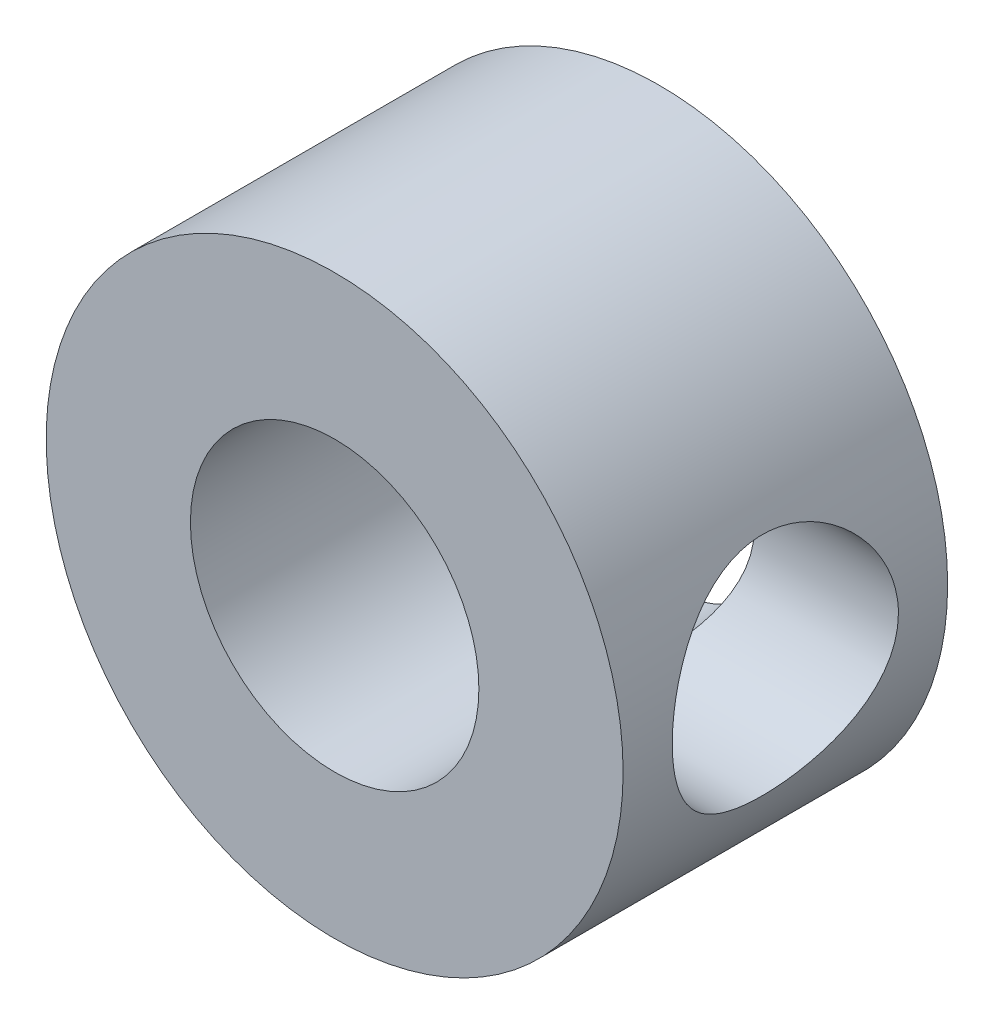
ISO-10303-21;
HEADER;
FILE_DESCRIPTION(('STEP AP214'),'2;1');
FILE_NAME('part.step','',(''),(''),'','','');
FILE_SCHEMA(('AUTOMOTIVE_DESIGN { 1 0 10303 214 1 1 1 1 }'));
ENDSEC;
DATA;
#1=APPLICATION_CONTEXT('core data for automotive mechanical design processes');
#2=APPLICATION_PROTOCOL_DEFINITION('international standard','automotive_design',2000,#1);
#3=PRODUCT_CONTEXT('',#1,'mechanical');
#4=PRODUCT('Part','Part','',(#3));
#5=PRODUCT_RELATED_PRODUCT_CATEGORY('part','',(#4));
#6=PRODUCT_DEFINITION_FORMATION('','',#4);
#7=PRODUCT_DEFINITION_CONTEXT('part definition',#1,'design');
#8=PRODUCT_DEFINITION('design','',#6,#7);
#9=PRODUCT_DEFINITION_SHAPE('','',#8);
#10=(LENGTH_UNIT() NAMED_UNIT(*) SI_UNIT(.MILLI.,.METRE.));
#11=(NAMED_UNIT(*) PLANE_ANGLE_UNIT() SI_UNIT($,.RADIAN.));
#12=(NAMED_UNIT(*) SI_UNIT($,.STERADIAN.) SOLID_ANGLE_UNIT());
#13=UNCERTAINTY_MEASURE_WITH_UNIT(LENGTH_MEASURE(1.E-05),#10,'distance_accuracy_value','');
#14=(GEOMETRIC_REPRESENTATION_CONTEXT(3) GLOBAL_UNCERTAINTY_ASSIGNED_CONTEXT((#13)) GLOBAL_UNIT_ASSIGNED_CONTEXT((#10,
#11,#12)) REPRESENTATION_CONTEXT('',''));
#15=CARTESIAN_POINT('',(0.,0.,0.));
#16=DIRECTION('',(0.,0.,1.));
#17=DIRECTION('',(1.,0.,0.));
#18=AXIS2_PLACEMENT_3D('',#15,#16,#17);
#19=CARTESIAN_POINT('',(0.,0.,7.14375));
#20=DIRECTION('',(0.,0.,1.));
#21=DIRECTION('',(1.,0.,0.));
#22=AXIS2_PLACEMENT_3D('',#19,#20,#21);
#23=PLANE('',#22);
#24=CARTESIAN_POINT('',(0.,0.,7.14375));
#25=DIRECTION('',(0.,0.,1.));
#26=DIRECTION('',(1.,0.,0.));
#27=AXIS2_PLACEMENT_3D('',#24,#25,#26);
#28=CIRCLE('',#27,6.35);
#29=CARTESIAN_POINT('',(6.35,0.,7.14375));
#30=VERTEX_POINT('',#29);
#31=EDGE_CURVE('E10',#30,#30,#28,.T.);
#32=ORIENTED_EDGE('',*,*,#31,.T.);
#33=EDGE_LOOP('',(#32));
#34=FACE_BOUND('',#33,.T.);
#35=CARTESIAN_POINT('',(0.,0.,7.14375));
#36=DIRECTION('',(0.,0.,1.));
#37=DIRECTION('',(1.,0.,0.));
#38=AXIS2_PLACEMENT_3D('',#35,#36,#37);
#39=CIRCLE('',#38,3.175);
#40=CARTESIAN_POINT('',(3.175,0.,7.14375));
#41=VERTEX_POINT('',#40);
#42=EDGE_CURVE('E45',#41,#41,#39,.T.);
#43=ORIENTED_EDGE('',*,*,#42,.F.);
#44=EDGE_LOOP('',(#43));
#45=FACE_BOUND('',#44,.T.);
#46=ADVANCED_FACE('F33',(#34,#45),#23,.T.);
#47=CARTESIAN_POINT('',(0.,0.,0.));
#48=DIRECTION('',(0.,0.,1.));
#49=DIRECTION('',(1.,0.,0.));
#50=AXIS2_PLACEMENT_3D('',#47,#48,#49);
#51=PLANE('',#50);
#52=CARTESIAN_POINT('',(0.,0.,0.));
#53=DIRECTION('',(0.,0.,1.));
#54=DIRECTION('',(1.,0.,0.));
#55=AXIS2_PLACEMENT_3D('',#52,#53,#54);
#56=CIRCLE('',#55,6.35);
#57=CARTESIAN_POINT('',(6.35,0.,0.));
#58=VERTEX_POINT('',#57);
#59=EDGE_CURVE('E38',#58,#58,#56,.T.);
#60=ORIENTED_EDGE('',*,*,#59,.F.);
#61=EDGE_LOOP('',(#60));
#62=FACE_BOUND('',#61,.T.);
#63=CARTESIAN_POINT('',(0.,0.,0.));
#64=DIRECTION('',(0.,0.,1.));
#65=DIRECTION('',(1.,0.,0.));
#66=AXIS2_PLACEMENT_3D('',#63,#64,#65);
#67=CIRCLE('',#66,3.175);
#68=CARTESIAN_POINT('',(3.175,0.,0.));
#69=VERTEX_POINT('',#68);
#70=EDGE_CURVE('E47',#69,#69,#67,.T.);
#71=ORIENTED_EDGE('',*,*,#70,.T.);
#72=EDGE_LOOP('',(#71));
#73=FACE_BOUND('',#72,.T.);
#74=ADVANCED_FACE('F74',(#62,#73),#51,.F.);
#75=CARTESIAN_POINT('',(0.,0.,7.14375));
#76=DIRECTION('',(0.,0.,-1.));
#77=DIRECTION('',(-1.,0.,0.));
#78=AXIS2_PLACEMENT_3D('',#75,#76,#77);
#79=CYLINDRICAL_SURFACE('',#78,6.35);
#80=CARTESIAN_POINT('',(6.35,0.,1.08336811795992));
#81=CARTESIAN_POINT('',(6.35000545513633,-0.134365584905921,1.08336104813344));
#82=CARTESIAN_POINT('',(6.34569919607395,-0.268685164184845,1.09428080479246));
#83=CARTESIAN_POINT('',(6.32895430273521,-0.533286588736778,1.13747493772504));
#84=CARTESIAN_POINT('',(6.31651764140518,-0.663569405550613,1.16974413330642));
#85=CARTESIAN_POINT('',(6.2848394308242,-0.916240679027884,1.25430465639991));
#86=CARTESIAN_POINT('',(6.26561175190318,-1.03864462990077,1.30655519084516));
#87=CARTESIAN_POINT('',(6.22224665454074,-1.27293328014172,1.42937770064108));
#88=CARTESIAN_POINT('',(6.19810780178079,-1.38481489244865,1.49995503003793));
#89=CARTESIAN_POINT('',(6.14615702665636,-1.60000446005501,1.66079297507217));
#90=CARTESIAN_POINT('',(6.11823466136445,-1.70276835120586,1.75174545573723));
#91=CARTESIAN_POINT('',(6.06238156007363,-1.89203184927024,1.94928304598323));
#92=CARTESIAN_POINT('',(6.03445082454259,-1.97852578470697,2.05587358380916));
#93=CARTESIAN_POINT('',(5.98042612533988,-2.13641590923239,2.28716443460609));
#94=CARTESIAN_POINT('',(5.95446032205108,-2.20701609317026,2.41244112554267));
#95=CARTESIAN_POINT('',(5.9090411931179,-2.32590038417542,2.67426493441599));
#96=CARTESIAN_POINT('',(5.88958499208708,-2.37419434782264,2.81080704293989));
#97=CARTESIAN_POINT('',(5.8605771307609,-2.44490220539705,3.08500300380676));
#98=CARTESIAN_POINT('',(5.8506274685615,-2.46836098023931,3.22234380326284));
#99=CARTESIAN_POINT('',(5.84060175728777,-2.49199779436003,3.49934538098847));
#100=CARTESIAN_POINT('',(5.84052112900121,-2.49218663084416,3.63900505321947));
#101=CARTESIAN_POINT('',(5.84990195005161,-2.47007217806116,3.90680123403268));
#102=CARTESIAN_POINT('',(5.85873047564688,-2.44926079151003,4.03508735854082));
#103=CARTESIAN_POINT('',(5.88387593621575,-2.38821734259702,4.28617466326235));
#104=CARTESIAN_POINT('',(5.90019410863688,-2.34798207094299,4.40897493341646));
#105=CARTESIAN_POINT('',(5.93883251538668,-2.2484784146089,4.64849611530154));
#106=CARTESIAN_POINT('',(5.96126601737259,-2.18884626402989,4.76504682552595));
#107=CARTESIAN_POINT('',(6.00957411421176,-2.05249627540497,4.98690356425207));
#108=CARTESIAN_POINT('',(6.03544996961245,-1.97577217152043,5.09220544798163));
#109=CARTESIAN_POINT('',(6.09005993945317,-1.8007407441697,5.29677236520375));
#110=CARTESIAN_POINT('',(6.11886388871933,-1.70125661271393,5.39501448050675));
#111=CARTESIAN_POINT('',(6.17445115700628,-1.48690981684088,5.57374064047986));
#112=CARTESIAN_POINT('',(6.20123410468441,-1.37204433693128,5.65422142685303));
#113=CARTESIAN_POINT('',(6.25038561038936,-1.1273897475065,5.79641152211744));
#114=CARTESIAN_POINT('',(6.27266443774011,-0.997366046580318,5.85775044930889));
#115=CARTESIAN_POINT('',(6.309623459392,-0.727751723244816,5.95733602874321));
#116=CARTESIAN_POINT('',(6.32430735422533,-0.588165797521133,5.99559392843186));
#117=CARTESIAN_POINT('',(6.3437553205587,-0.311975114697822,6.04589613336093));
#118=CARTESIAN_POINT('',(6.34903926581758,-0.175657331323717,6.05931601606586));
#119=CARTESIAN_POINT('',(6.35071944123578,0.097370738910688,6.06360464416098));
#120=CARTESIAN_POINT('',(6.3471178638622,0.234080920634157,6.0544789525805));
#121=CARTESIAN_POINT('',(6.33177301842518,0.497873293930373,6.01495848636519));
#122=CARTESIAN_POINT('',(6.32038463721726,0.625117175209849,5.98549028857833));
#123=CARTESIAN_POINT('',(6.29097552295061,0.872746274965058,5.90736873269536));
#124=CARTESIAN_POINT('',(6.27295393308272,0.993130605074175,5.85871289608085));
#125=CARTESIAN_POINT('',(6.23135931272748,1.22771687293366,5.74201741597362));
#126=CARTESIAN_POINT('',(6.20763478732306,1.34162146893583,5.67343573380022));
#127=CARTESIAN_POINT('',(6.15722385682927,1.55670058460538,5.51944009908576));
#128=CARTESIAN_POINT('',(6.13053629420074,1.6578700960226,5.43401955810396));
#129=CARTESIAN_POINT('',(6.0750169513665,1.85133337687063,5.24240922254003));
#130=CARTESIAN_POINT('',(6.04615654147027,1.94265704219348,5.13524567838425));
#131=CARTESIAN_POINT('',(5.9911341280294,2.10624816133522,4.90658405407908));
#132=CARTESIAN_POINT('',(5.96497249827361,2.17851297760018,4.78508399326331));
#133=CARTESIAN_POINT('',(5.91832247370527,2.3022571820242,4.52965274527073));
#134=CARTESIAN_POINT('',(5.89787962530376,2.35357111565625,4.39563250143547));
#135=CARTESIAN_POINT('',(5.86576301128476,2.43252456542703,4.11981564601188));
#136=CARTESIAN_POINT('',(5.85408312112941,2.4601806182444,3.97802454008569));
#137=CARTESIAN_POINT('',(5.84167696022346,2.48948586384106,3.70130952553694));
#138=CARTESIAN_POINT('',(5.84024579758222,2.49280902406863,3.56659327741807));
#139=CARTESIAN_POINT('',(5.84666520244753,2.47771522167332,3.29862282018771));
#140=CARTESIAN_POINT('',(5.85451470694218,2.45930074888935,3.16536844539687));
#141=CARTESIAN_POINT('',(5.87800035129194,2.40260151094814,2.90906917580799));
#142=CARTESIAN_POINT('',(5.8933420997075,2.36506583800947,2.78582917931971));
#143=CARTESIAN_POINT('',(5.92988758474608,2.27187710188837,2.54733941403855));
#144=CARTESIAN_POINT('',(5.95109286317444,2.21621927283125,2.43209175680109));
#145=CARTESIAN_POINT('',(5.99844525911191,2.08477495158031,2.20586165341153));
#146=CARTESIAN_POINT('',(6.02480198593947,2.00803922516091,2.0954752502654));
#147=CARTESIAN_POINT('',(6.07882330885569,1.83803081049928,1.88861498013543));
#148=CARTESIAN_POINT('',(6.10648833718916,1.74475262846769,1.79214575444084));
#149=CARTESIAN_POINT('',(6.16204641164539,1.53748636811623,1.60980474002559));
#150=CARTESIAN_POINT('',(6.18984947752698,1.42257928032945,1.52494508365494));
#151=CARTESIAN_POINT('',(6.24079820469859,1.17915056720893,1.37572789268335));
#152=CARTESIAN_POINT('',(6.26394274398275,1.05062567337776,1.31137529503484));
#153=CARTESIAN_POINT('',(6.30455046538143,0.772309883998053,1.20110415456855));
#154=CARTESIAN_POINT('',(6.32138644594636,0.621639311170629,1.1571473631246));
#155=CARTESIAN_POINT('',(6.34410455966513,0.313955516139854,1.09829267306016));
#156=CARTESIAN_POINT('',(6.34999362810151,0.15694637413187,1.08337637590509));
#157=CARTESIAN_POINT('',(6.35,0.,1.08336811795992));
#158=B_SPLINE_CURVE_WITH_KNOTS('',3,(#80,#81,#82,#83,#84,#85,#86,#87,#88,#89,#90,#91,#92,#93,
#94,#95,#96,#97,#98,#99,#100,#101,#102,#103,#104,#105,#106,#107,#108,#109,#110,#111,#112,#113,
#114,#115,#116,#117,#118,#119,#120,#121,#122,#123,#124,#125,#126,#127,#128,#129,#130,#131,#132,
#133,#134,#135,#136,#137,#138,#139,#140,#141,#142,#143,#144,#145,#146,#147,#148,#149,#150,#151,
#152,#153,#154,#155,#156,#157),.UNSPECIFIED.,.T.,.F.,(4,2,2,2,2,2,2,2,2,2,2,2,2,2,2,2,2,2,2,2,2,
2,2,2,2,2,2,2,2,2,2,2,2,2,2,2,2,2,4),(0.,0.402517372326175,0.804937104890773,1.20653962266429,
1.60825959808787,2.02655113714875,2.44498821761558,2.8811738451615,3.31716654798881,
3.73398252647921,4.15060510244613,4.53957769623242,4.92861457963694,5.32541428988972,
5.72235970533967,6.14867096901134,6.57506037414245,7.00925096681115,7.44322980599411,
7.85235854945978,8.26138635214465,8.65291623689808,9.04449671318398,9.44792730216544,
9.85151605347308,10.2807058136537,10.7099549382714,11.1425312737321,11.5748049939773,
11.9770342019763,12.3792173429191,12.7667341864249,13.1543530238891,13.5635829831829,
13.9729491041067,14.4074095146285,14.841974440031,15.3124349682516,15.7825973402303),.UNSPECIFIED.);
#159=CARTESIAN_POINT('',(6.35,0.,1.08336811795992));
#160=VERTEX_POINT('',#159);
#161=EDGE_CURVE('E50',#160,#160,#158,.T.);
#162=ORIENTED_EDGE('',*,*,#161,.T.);
#163=EDGE_LOOP('',(#162));
#164=FACE_BOUND('',#163,.T.);
#165=ORIENTED_EDGE('',*,*,#31,.F.);
#166=EDGE_LOOP('',(#165));
#167=FACE_BOUND('',#166,.T.);
#168=ORIENTED_EDGE('',*,*,#59,.T.);
#169=EDGE_LOOP('',(#168));
#170=FACE_BOUND('',#169,.T.);
#171=ADVANCED_FACE('F35',(#164,#167,#170),#79,.T.);
#172=CARTESIAN_POINT('',(0.,0.,7.14375));
#173=DIRECTION('',(0.,0.,-1.));
#174=DIRECTION('',(-1.,0.,0.));
#175=AXIS2_PLACEMENT_3D('',#172,#173,#174);
#176=CYLINDRICAL_SURFACE('',#175,3.175);
#177=CARTESIAN_POINT('',(3.175,0.,1.08336811795992));
#178=CARTESIAN_POINT('',(3.17499077465697,-0.120148549606853,1.08337766341516));
#179=CARTESIAN_POINT('',(3.1681096127634,-0.240466896541145,1.09213855070303));
#180=CARTESIAN_POINT('',(3.14119918852922,-0.477253620417398,1.12660508165126));
#181=CARTESIAN_POINT('',(3.12114159062693,-0.593713130802186,1.15234724357199));
#182=CARTESIAN_POINT('',(3.06978299402944,-0.818715011095252,1.2189526113658));
#183=CARTESIAN_POINT('',(3.0385524418292,-0.927301971642024,1.25972112238641));
#184=CARTESIAN_POINT('',(2.96712993598231,-1.13528843336686,1.35439013212306));
#185=CARTESIAN_POINT('',(2.92693782757086,-1.23468777583412,1.40829085763209));
#186=CARTESIAN_POINT('',(2.82530170373867,-1.45519445120767,1.54752238907819));
#187=CARTESIAN_POINT('',(2.761266326125,-1.57228272888061,1.6373186641381));
#188=CARTESIAN_POINT('',(2.62709987106614,-1.78748062839146,1.83406510445368));
#189=CARTESIAN_POINT('',(2.55695167954914,-1.88553431298691,1.94106418839555));
#190=CARTESIAN_POINT('',(2.45157932097569,-2.01832990183734,2.1138602584097));
#191=CARTESIAN_POINT('',(2.41616836926209,-2.06047086691977,2.17399895839576));
#192=CARTESIAN_POINT('',(2.34642637181007,-2.13955191062702,2.29825957161003));
#193=CARTESIAN_POINT('',(2.31209565194185,-2.17649043130918,2.36238266977044));
#194=CARTESIAN_POINT('',(2.24580880352831,-2.24482238177368,2.49442237946217));
#195=CARTESIAN_POINT('',(2.21384613339129,-2.27623144446941,2.56232755767132));
#196=CARTESIAN_POINT('',(2.15367128586002,-2.33324700720927,2.7020707998464));
#197=CARTESIAN_POINT('',(2.1254559824389,-2.358858356391,2.77390551428228));
#198=CARTESIAN_POINT('',(2.07000839593962,-2.40775633375999,2.93455589599839));
#199=CARTESIAN_POINT('',(2.04383407244479,-2.42982910033466,3.02412667620183));
#200=CARTESIAN_POINT('',(2.00246481002019,-2.46404107189859,3.20749905230508));
#201=CARTESIAN_POINT('',(1.98724391214957,-2.47620377224677,3.30129008168061));
#202=CARTESIAN_POINT('',(1.97029094345844,-2.48972193607632,3.49164085515126));
#203=CARTESIAN_POINT('',(1.96865893526056,-2.49099723121546,3.58821589234929));
#204=CARTESIAN_POINT('',(1.97948542167779,-2.4823975963315,3.78010300065304));
#205=CARTESIAN_POINT('',(1.99195869910855,-2.47251096825373,3.8754136406275));
#206=CARTESIAN_POINT('',(2.03203165055581,-2.43971992926502,4.07889149447292));
#207=CARTESIAN_POINT('',(2.06196721457835,-2.41477728031308,4.18624966479532));
#208=CARTESIAN_POINT('',(2.13281475577729,-2.35243408127207,4.39351639035567));
#209=CARTESIAN_POINT('',(2.17375756322819,-2.3149984673631,4.49340299830996));
#210=CARTESIAN_POINT('',(2.28122864549803,-2.21007706839609,4.72786983329973));
#211=CARTESIAN_POINT('',(2.35106262246214,-2.13662392350756,4.8582485606215));
#212=CARTESIAN_POINT('',(2.49340788528794,-1.96869040015313,5.10306609041966));
#213=CARTESIAN_POINT('',(2.56592252109557,-1.87418291506784,5.21748403240851));
#214=CARTESIAN_POINT('',(2.70785566772883,-1.6627323980595,5.43117953968382));
#215=CARTESIAN_POINT('',(2.77719090282655,-1.54540280287067,5.5301339004161));
#216=CARTESIAN_POINT('',(2.90440707709722,-1.29042952740294,5.70676507214841));
#217=CARTESIAN_POINT('',(2.96231984207993,-1.15284421014859,5.78450124139344));
#218=CARTESIAN_POINT('',(3.04578746942509,-0.903165468980892,5.89489230225406));
#219=CARTESIAN_POINT('',(3.07585018340982,-0.795457372372131,5.93408202239028));
#220=CARTESIAN_POINT('',(3.12487312026258,-0.573312356909136,5.99759117042105));
#221=CARTESIAN_POINT('',(3.14384180552319,-0.458880640270538,6.02192193317852));
#222=CARTESIAN_POINT('',(3.16913579784923,-0.225819272006881,6.05430472857289));
#223=CARTESIAN_POINT('',(3.17540659534134,-0.10717373725391,6.06228658018093));
#224=CARTESIAN_POINT('',(3.174552401305,0.12999349345293,6.06119735543196));
#225=CARTESIAN_POINT('',(3.16742782295058,0.248515193113612,6.05212680504819));
#226=CARTESIAN_POINT('',(3.14135165415904,0.473882131512213,6.01872421172443));
#227=CARTESIAN_POINT('',(3.12321092897439,0.580981969546291,5.99543796892216));
#228=CARTESIAN_POINT('',(3.0771888621927,0.789252475747356,5.93581612282462));
#229=CARTESIAN_POINT('',(3.04930518534765,0.890421715638781,5.89947739097347));
#230=CARTESIAN_POINT('',(2.98307686567285,1.0927403484989,5.81201459124982));
#231=CARTESIAN_POINT('',(2.9440846013145,1.19326928312216,5.75995639682192));
#232=CARTESIAN_POINT('',(2.85925073119461,1.38428751268958,5.64436609242889));
#233=CARTESIAN_POINT('',(2.81340590959415,1.47477205896898,5.58082859239892));
#234=CARTESIAN_POINT('',(2.70790741376032,1.66177993841125,5.43043817197226));
#235=CARTESIAN_POINT('',(2.64730298151354,1.75604938947874,5.34145430192736));
#236=CARTESIAN_POINT('',(2.52387692568177,1.92924549346095,5.1507804172054));
#237=CARTESIAN_POINT('',(2.46105239803647,2.00815109992597,5.04907328205525));
#238=CARTESIAN_POINT('',(2.3403858548065,2.14741188746853,4.83755597848821));
#239=CARTESIAN_POINT('',(2.282445550735,2.2083432790624,4.72818224176806));
#240=CARTESIAN_POINT('',(2.1750358328439,2.31419580926941,4.49808517206906));
#241=CARTESIAN_POINT('',(2.12554868149957,2.35915069169173,4.37738644874655));
#242=CARTESIAN_POINT('',(2.05614212592924,2.41957525489607,4.16413889558228));
#243=CARTESIAN_POINT('',(2.03181158398945,2.43986387835182,4.07442585408533));
#244=CARTESIAN_POINT('',(1.99448433853185,2.4704763421776,3.89109177332593));
#245=CARTESIAN_POINT('',(1.98146263696508,2.48082216640876,3.79747983540449));
#246=CARTESIAN_POINT('',(1.9689671024042,2.49075756886656,3.60815904557706));
#247=CARTESIAN_POINT('',(1.96957558354668,2.49028179402903,3.51244094272197));
#248=CARTESIAN_POINT('',(1.98442534076389,2.47845815175288,3.32271145706645));
#249=CARTESIAN_POINT('',(1.99868399514015,2.46709642518158,3.22870240557478));
#250=CARTESIAN_POINT('',(2.04277139096443,2.43077693785677,3.02438757862479));
#251=CARTESIAN_POINT('',(2.07537157207081,2.40334450881505,2.91514603721977));
#252=CARTESIAN_POINT('',(2.15131485110867,2.33560281703383,2.70459020134824));
#253=CARTESIAN_POINT('',(2.19468827012361,2.29525711601421,2.60329936139312));
#254=CARTESIAN_POINT('',(2.2738761568487,2.21636904523689,2.4369242726003));
#255=CARTESIAN_POINT('',(2.30828641306224,2.18063359276177,2.3697932294055));
#256=CARTESIAN_POINT('',(2.37869712353081,2.10360325060477,2.23964167676299));
#257=CARTESIAN_POINT('',(2.41469818488518,2.06230622593002,2.17662275975088));
#258=CARTESIAN_POINT('',(2.48717243736732,1.97429685114386,2.05470117013476));
#259=CARTESIAN_POINT('',(2.52364589677189,1.92758129222334,1.99580097003011));
#260=CARTESIAN_POINT('',(2.59608967271852,1.82885421432538,1.882278661672));
#261=CARTESIAN_POINT('',(2.63205972252344,1.77684000027009,1.82765875576379));
#262=CARTESIAN_POINT('',(2.73883925798994,1.61142182890421,1.66917117990127));
#263=CARTESIAN_POINT('',(2.80759350273888,1.4897113165845,1.57216867962646));
#264=CARTESIAN_POINT('',(2.90111123434913,1.29209633902029,1.44353646151679));
#265=CARTESIAN_POINT('',(2.93066776042052,1.22375868452034,1.40348857932225));
#266=CARTESIAN_POINT('',(2.98579378955539,1.08231649644751,1.32956381494118));
#267=CARTESIAN_POINT('',(3.01136552467671,1.00921466428529,1.2956834762384));
#268=CARTESIAN_POINT('',(3.06638979076456,0.830420403311786,1.22331692257481));
#269=CARTESIAN_POINT('',(3.09369472408523,0.722796439959993,1.18787727039582));
#270=CARTESIAN_POINT('',(3.1371114336789,0.501766718040001,1.13181474635947));
#271=CARTESIAN_POINT('',(3.15325211281231,0.388376711204156,1.11115360999724));
#272=CARTESIAN_POINT('',(3.16710591305641,0.228366157219009,1.09344367990749));
#273=CARTESIAN_POINT('',(3.170060077281,0.182836838920424,1.08967158089008));
#274=CARTESIAN_POINT('',(3.17400910026885,0.0915465996891495,1.0846316977263));
#275=CARTESIAN_POINT('',(3.17500351554914,0.0457856286827823,1.08336448042397));
#276=CARTESIAN_POINT('',(3.175,0.,1.08336811795992));
#277=B_SPLINE_CURVE_WITH_KNOTS('',3,(#177,#178,#179,#180,#181,#182,#183,#184,#185,#186,#187,
#188,#189,#190,#191,#192,#193,#194,#195,#196,#197,#198,#199,#200,#201,#202,#203,#204,#205,#206,
#207,#208,#209,#210,#211,#212,#213,#214,#215,#216,#217,#218,#219,#220,#221,#222,#223,#224,#225,
#226,#227,#228,#229,#230,#231,#232,#233,#234,#235,#236,#237,#238,#239,#240,#241,#242,#243,#244,
#245,#246,#247,#248,#249,#250,#251,#252,#253,#254,#255,#256,#257,#258,#259,#260,#261,#262,#263,
#264,#265,#266,#267,#268,#269,#270,#271,#272,#273,#274,#275,#276),.UNSPECIFIED.,.T.,.F.,(4,2,2,
2,2,2,2,2,2,2,2,2,2,2,2,2,2,2,2,2,2,2,2,2,2,2,2,2,2,2,2,2,2,2,2,2,2,2,2,2,2,2,2,2,2,2,2,2,2,4),
(0.,0.360246740194342,0.721270728258031,1.08005742326942,1.43885031495657,1.91891975938771,
2.40037931537212,2.64474237217335,2.88917845192149,3.13291195684194,3.37644084654709,
3.66307452157385,3.94902663513721,4.23708252934773,4.52544059587389,4.8661723009413,
5.20786849038102,5.70073345206051,6.19423666285888,6.69697012950283,7.19828243055829,
7.55232099154464,7.90608914274016,8.26137275976935,8.61664541842368,8.94849101356248,
9.28041620202967,9.63830280327478,9.99635788764058,10.4241206255594,10.8524652821372,
11.2650330038513,11.6767240934151,11.9611169559599,12.2448795597926,12.5303562959285,
12.8161969620675,13.1660404890724,13.5168800284545,13.7670082783071,14.0172328233056,
14.2676063130236,14.5181077932412,15.0252098093295,15.2784790974331,15.531606004244,
15.879769103487,16.2270274438853,16.3642774752543,16.5015585621646),.UNSPECIFIED.);
#278=CARTESIAN_POINT('',(3.175,0.,1.08336811795992));
#279=VERTEX_POINT('',#278);
#280=EDGE_CURVE('E58',#279,#279,#277,.T.);
#281=ORIENTED_EDGE('',*,*,#280,.F.);
#282=EDGE_LOOP('',(#281));
#283=FACE_BOUND('',#282,.T.);
#284=ORIENTED_EDGE('',*,*,#42,.T.);
#285=EDGE_LOOP('',(#284));
#286=FACE_BOUND('',#285,.T.);
#287=ORIENTED_EDGE('',*,*,#70,.F.);
#288=EDGE_LOOP('',(#287));
#289=FACE_BOUND('',#288,.T.);
#290=ADVANCED_FACE('F65',(#283,#286,#289),#176,.F.);
#291=CARTESIAN_POINT('',(6.35,0.,3.57256811795992));
#292=DIRECTION('',(1.,0.,0.));
#293=DIRECTION('',(0.,0.,-1.));
#294=AXIS2_PLACEMENT_3D('',#291,#292,#293);
#295=CYLINDRICAL_SURFACE('',#294,2.48919999999999);
#296=ORIENTED_EDGE('',*,*,#280,.T.);
#297=EDGE_LOOP('',(#296));
#298=FACE_BOUND('',#297,.T.);
#299=ORIENTED_EDGE('',*,*,#161,.F.);
#300=EDGE_LOOP('',(#299));
#301=FACE_BOUND('',#300,.T.);
#302=ADVANCED_FACE('F62',(#298,#301),#295,.F.);
#303=CLOSED_SHELL('',(#46,#74,#171,#290,#302));
#304=MANIFOLD_SOLID_BREP('B2',#303);
#305=ADVANCED_BREP_SHAPE_REPRESENTATION('',(#18,#304),#14);
#306=SHAPE_DEFINITION_REPRESENTATION(#9,#305);
ENDSEC;
END-ISO-10303-21;
